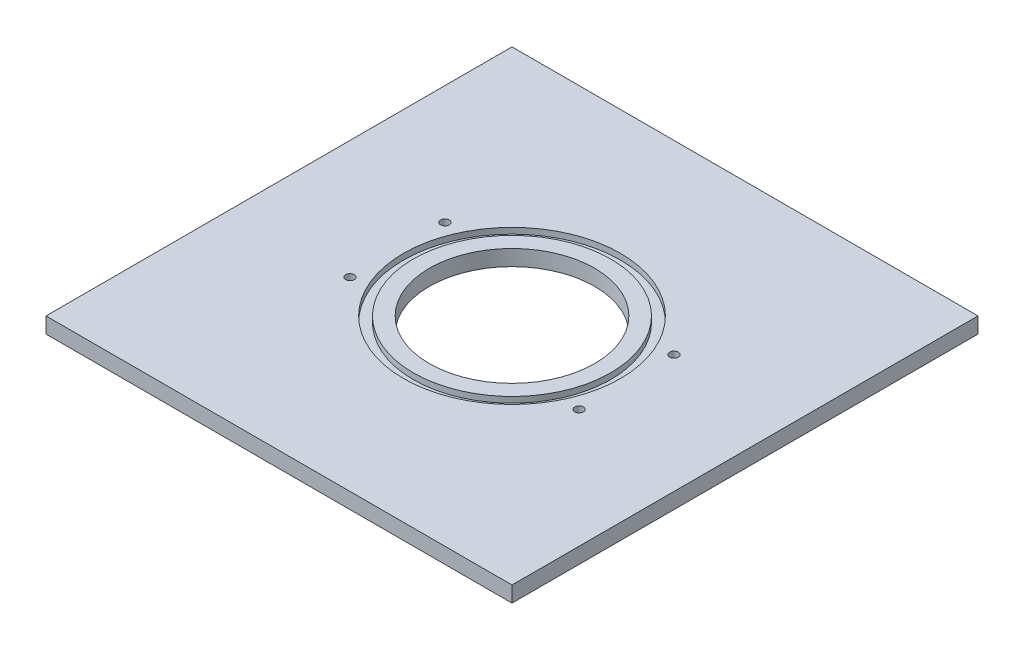
ISO-10303-21;
HEADER;
FILE_DESCRIPTION(('STEP AP214'),'2;1');
FILE_NAME('part.step','',(''),(''),'','','');
FILE_SCHEMA(('AUTOMOTIVE_DESIGN { 1 0 10303 214 1 1 1 1 }'));
ENDSEC;
DATA;
#1=APPLICATION_CONTEXT('core data for automotive mechanical design processes');
#2=APPLICATION_PROTOCOL_DEFINITION('international standard','automotive_design',2000,#1);
#3=PRODUCT_CONTEXT('',#1,'mechanical');
#4=PRODUCT('Part','Part','',(#3));
#5=PRODUCT_RELATED_PRODUCT_CATEGORY('part','',(#4));
#6=PRODUCT_DEFINITION_FORMATION('','',#4);
#7=PRODUCT_DEFINITION_CONTEXT('part definition',#1,'design');
#8=PRODUCT_DEFINITION('design','',#6,#7);
#9=PRODUCT_DEFINITION_SHAPE('','',#8);
#10=(LENGTH_UNIT() NAMED_UNIT(*) SI_UNIT(.MILLI.,.METRE.));
#11=(NAMED_UNIT(*) PLANE_ANGLE_UNIT() SI_UNIT($,.RADIAN.));
#12=(NAMED_UNIT(*) SI_UNIT($,.STERADIAN.) SOLID_ANGLE_UNIT());
#13=UNCERTAINTY_MEASURE_WITH_UNIT(LENGTH_MEASURE(1.E-05),#10,'distance_accuracy_value','');
#14=(GEOMETRIC_REPRESENTATION_CONTEXT(3) GLOBAL_UNCERTAINTY_ASSIGNED_CONTEXT((#13)) GLOBAL_UNIT_ASSIGNED_CONTEXT((#10,
#11,#12)) REPRESENTATION_CONTEXT('',''));
#15=CARTESIAN_POINT('',(0.,0.,0.));
#16=DIRECTION('',(0.,0.,1.));
#17=DIRECTION('',(1.,0.,0.));
#18=AXIS2_PLACEMENT_3D('',#15,#16,#17);
#19=CARTESIAN_POINT('',(0.,7.62,0.));
#20=DIRECTION('',(0.,1.,0.));
#21=DIRECTION('',(0.,0.,1.));
#22=AXIS2_PLACEMENT_3D('',#19,#20,#21);
#23=PLANE('',#22);
#24=CARTESIAN_POINT('',(0.,7.62,0.));
#25=DIRECTION('',(0.,1.,0.));
#26=DIRECTION('',(0.,0.,1.));
#27=AXIS2_PLACEMENT_3D('',#24,#25,#26);
#28=CIRCLE('',#27,40.);
#29=CARTESIAN_POINT('',(0.,7.62,-40.));
#30=VERTEX_POINT('',#29);
#31=EDGE_CURVE('E113',#30,#30,#28,.T.);
#32=ORIENTED_EDGE('',*,*,#31,.F.);
#33=EDGE_LOOP('',(#32));
#34=FACE_BOUND('',#33,.T.);
#35=CARTESIAN_POINT('',(0.,7.62,0.));
#36=DIRECTION('',(0.,1.,0.));
#37=DIRECTION('',(0.,0.,1.));
#38=AXIS2_PLACEMENT_3D('',#35,#36,#37);
#39=CIRCLE('',#38,47.7502);
#40=CARTESIAN_POINT('',(0.,7.62,47.7502));
#41=VERTEX_POINT('',#40);
#42=EDGE_CURVE('E130',#41,#41,#39,.T.);
#43=ORIENTED_EDGE('',*,*,#42,.T.);
#44=EDGE_LOOP('',(#43));
#45=FACE_BOUND('',#44,.T.);
#46=ADVANCED_FACE('F45',(#34,#45),#23,.T.);
#47=CARTESIAN_POINT('',(112.776,7.62,0.));
#48=DIRECTION('',(1.,0.,0.));
#49=DIRECTION('',(0.,0.,-1.));
#50=AXIS2_PLACEMENT_3D('',#47,#48,#49);
#51=PLANE('',#50);
#52=DIRECTION('',(0.,0.,1.));
#53=VECTOR('',#52,1.);
#54=CARTESIAN_POINT('',(112.776,0.,0.));
#55=LINE('',#54,#53);
#56=CARTESIAN_POINT('',(112.776,0.,-112.776));
#57=VERTEX_POINT('',#56);
#58=CARTESIAN_POINT('',(112.776,0.,112.776));
#59=VERTEX_POINT('',#58);
#60=EDGE_CURVE('E116',#57,#59,#55,.T.);
#61=ORIENTED_EDGE('',*,*,#60,.F.);
#62=DIRECTION('',(0.,-1.,0.));
#63=VECTOR('',#62,1.);
#64=CARTESIAN_POINT('',(112.776,7.62,-112.776));
#65=LINE('',#64,#63);
#66=CARTESIAN_POINT('',(112.776,7.62,-112.776));
#67=VERTEX_POINT('',#66);
#68=EDGE_CURVE('E12',#67,#57,#65,.T.);
#69=ORIENTED_EDGE('',*,*,#68,.F.);
#70=DIRECTION('',(0.,0.,1.));
#71=VECTOR('',#70,1.);
#72=CARTESIAN_POINT('',(112.776,7.62,0.));
#73=LINE('',#72,#71);
#74=CARTESIAN_POINT('',(112.776,7.62,112.776));
#75=VERTEX_POINT('',#74);
#76=EDGE_CURVE('E106',#67,#75,#73,.T.);
#77=ORIENTED_EDGE('',*,*,#76,.T.);
#78=DIRECTION('',(0.,-1.,0.));
#79=VECTOR('',#78,1.);
#80=CARTESIAN_POINT('',(112.776,7.62,112.776));
#81=LINE('',#80,#79);
#82=EDGE_CURVE('E86',#75,#59,#81,.T.);
#83=ORIENTED_EDGE('',*,*,#82,.T.);
#84=EDGE_LOOP('',(#61,#69,#77,#83));
#85=FACE_BOUND('',#84,.T.);
#86=ADVANCED_FACE('F47',(#85),#51,.T.);
#87=CARTESIAN_POINT('',(0.,7.62,-112.776));
#88=DIRECTION('',(0.,0.,-1.));
#89=DIRECTION('',(-1.,0.,0.));
#90=AXIS2_PLACEMENT_3D('',#87,#88,#89);
#91=PLANE('',#90);
#92=DIRECTION('',(1.,0.,0.));
#93=VECTOR('',#92,1.);
#94=CARTESIAN_POINT('',(0.,0.,-112.776));
#95=LINE('',#94,#93);
#96=CARTESIAN_POINT('',(-112.776,0.,-112.776));
#97=VERTEX_POINT('',#96);
#98=EDGE_CURVE('E99',#97,#57,#95,.T.);
#99=ORIENTED_EDGE('',*,*,#98,.F.);
#100=DIRECTION('',(0.,-1.,0.));
#101=VECTOR('',#100,1.);
#102=CARTESIAN_POINT('',(-112.776,7.62,-112.776));
#103=LINE('',#102,#101);
#104=CARTESIAN_POINT('',(-112.776,7.62,-112.776));
#105=VERTEX_POINT('',#104);
#106=EDGE_CURVE('E55',#105,#97,#103,.T.);
#107=ORIENTED_EDGE('',*,*,#106,.F.);
#108=DIRECTION('',(1.,0.,0.));
#109=VECTOR('',#108,1.);
#110=CARTESIAN_POINT('',(0.,7.62,-112.776));
#111=LINE('',#110,#109);
#112=EDGE_CURVE('E97',#105,#67,#111,.T.);
#113=ORIENTED_EDGE('',*,*,#112,.T.);
#114=ORIENTED_EDGE('',*,*,#68,.T.);
#115=EDGE_LOOP('',(#99,#107,#113,#114));
#116=FACE_BOUND('',#115,.T.);
#117=ADVANCED_FACE('F95',(#116),#91,.T.);
#118=CARTESIAN_POINT('',(-112.776,7.62,0.));
#119=DIRECTION('',(1.,0.,0.));
#120=DIRECTION('',(0.,0.,-1.));
#121=AXIS2_PLACEMENT_3D('',#118,#119,#120);
#122=PLANE('',#121);
#123=DIRECTION('',(0.,0.,1.));
#124=VECTOR('',#123,1.);
#125=CARTESIAN_POINT('',(-112.776,0.,0.));
#126=LINE('',#125,#124);
#127=CARTESIAN_POINT('',(-112.776,0.,112.776));
#128=VERTEX_POINT('',#127);
#129=EDGE_CURVE('E79',#97,#128,#126,.T.);
#130=ORIENTED_EDGE('',*,*,#129,.T.);
#131=DIRECTION('',(0.,-1.,0.));
#132=VECTOR('',#131,1.);
#133=CARTESIAN_POINT('',(-112.776,7.62,112.776));
#134=LINE('',#133,#132);
#135=CARTESIAN_POINT('',(-112.776,7.62,112.776));
#136=VERTEX_POINT('',#135);
#137=EDGE_CURVE('E100',#136,#128,#134,.T.);
#138=ORIENTED_EDGE('',*,*,#137,.F.);
#139=DIRECTION('',(0.,0.,1.));
#140=VECTOR('',#139,1.);
#141=CARTESIAN_POINT('',(-112.776,7.62,0.));
#142=LINE('',#141,#140);
#143=EDGE_CURVE('E102',#105,#136,#142,.T.);
#144=ORIENTED_EDGE('',*,*,#143,.F.);
#145=ORIENTED_EDGE('',*,*,#106,.T.);
#146=EDGE_LOOP('',(#130,#138,#144,#145));
#147=FACE_BOUND('',#146,.T.);
#148=ADVANCED_FACE('F103',(#147),#122,.F.);
#149=CARTESIAN_POINT('',(0.,7.62,112.776));
#150=DIRECTION('',(0.,0.,-1.));
#151=DIRECTION('',(-1.,0.,0.));
#152=AXIS2_PLACEMENT_3D('',#149,#150,#151);
#153=PLANE('',#152);
#154=DIRECTION('',(1.,0.,0.));
#155=VECTOR('',#154,1.);
#156=CARTESIAN_POINT('',(0.,0.,112.776));
#157=LINE('',#156,#155);
#158=EDGE_CURVE('E122',#128,#59,#157,.T.);
#159=ORIENTED_EDGE('',*,*,#158,.T.);
#160=ORIENTED_EDGE('',*,*,#82,.F.);
#161=DIRECTION('',(1.,0.,0.));
#162=VECTOR('',#161,1.);
#163=CARTESIAN_POINT('',(0.,7.62,112.776));
#164=LINE('',#163,#162);
#165=EDGE_CURVE('E64',#136,#75,#164,.T.);
#166=ORIENTED_EDGE('',*,*,#165,.F.);
#167=ORIENTED_EDGE('',*,*,#137,.T.);
#168=EDGE_LOOP('',(#159,#160,#166,#167));
#169=FACE_BOUND('',#168,.T.);
#170=ADVANCED_FACE('F171',(#169),#153,.F.);
#171=CARTESIAN_POINT('',(0.,7.62,0.));
#172=DIRECTION('',(0.,-1.,0.));
#173=DIRECTION('',(0.,0.,-1.));
#174=AXIS2_PLACEMENT_3D('',#171,#172,#173);
#175=CYLINDRICAL_SURFACE('',#174,40.);
#176=CARTESIAN_POINT('',(0.,0.,0.));
#177=DIRECTION('',(0.,1.,0.));
#178=DIRECTION('',(0.,0.,1.));
#179=AXIS2_PLACEMENT_3D('',#176,#177,#178);
#180=CIRCLE('',#179,40.);
#181=CARTESIAN_POINT('',(0.,0.,-40.));
#182=VERTEX_POINT('',#181);
#183=EDGE_CURVE('E108',#182,#182,#180,.T.);
#184=CARTESIAN_POINT('',(0.,7.62,-40.));
#185=CARTESIAN_POINT('',(0.,7.540625,-40.));
#186=CARTESIAN_POINT('',(0.,7.46125,-40.));
#187=CARTESIAN_POINT('',(0.,7.3025,-40.));
#188=CARTESIAN_POINT('',(0.,7.223125,-40.));
#189=CARTESIAN_POINT('',(0.,7.064375,-40.));
#190=CARTESIAN_POINT('',(0.,6.985,-40.));
#191=CARTESIAN_POINT('',(0.,6.82625,-40.));
#192=CARTESIAN_POINT('',(0.,6.746875,-40.));
#193=CARTESIAN_POINT('',(0.,6.588125,-40.));
#194=CARTESIAN_POINT('',(0.,6.50875,-40.));
#195=CARTESIAN_POINT('',(0.,6.35,-40.));
#196=CARTESIAN_POINT('',(0.,6.270625,-40.));
#197=CARTESIAN_POINT('',(0.,6.111875,-40.));
#198=CARTESIAN_POINT('',(0.,6.0325,-40.));
#199=CARTESIAN_POINT('',(0.,5.87375,-40.));
#200=CARTESIAN_POINT('',(0.,5.794375,-40.));
#201=CARTESIAN_POINT('',(0.,5.635625,-40.));
#202=CARTESIAN_POINT('',(0.,5.55625,-40.));
#203=CARTESIAN_POINT('',(0.,5.3975,-40.));
#204=CARTESIAN_POINT('',(0.,5.318125,-40.));
#205=CARTESIAN_POINT('',(0.,5.159375,-40.));
#206=CARTESIAN_POINT('',(0.,5.08,-40.));
#207=CARTESIAN_POINT('',(0.,4.92125,-40.));
#208=CARTESIAN_POINT('',(0.,4.841875,-40.));
#209=CARTESIAN_POINT('',(0.,4.683125,-40.));
#210=CARTESIAN_POINT('',(0.,4.60375,-40.));
#211=CARTESIAN_POINT('',(0.,4.445,-40.));
#212=CARTESIAN_POINT('',(0.,4.365625,-40.));
#213=CARTESIAN_POINT('',(0.,4.206875,-40.));
#214=CARTESIAN_POINT('',(0.,4.1275,-40.));
#215=CARTESIAN_POINT('',(0.,3.96875,-40.));
#216=CARTESIAN_POINT('',(0.,3.889375,-40.));
#217=CARTESIAN_POINT('',(0.,3.730625,-40.));
#218=CARTESIAN_POINT('',(0.,3.65125,-40.));
#219=CARTESIAN_POINT('',(0.,3.4925,-40.));
#220=CARTESIAN_POINT('',(0.,3.413125,-40.));
#221=CARTESIAN_POINT('',(0.,3.254375,-40.));
#222=CARTESIAN_POINT('',(0.,3.175,-40.));
#223=CARTESIAN_POINT('',(0.,3.01625,-40.));
#224=CARTESIAN_POINT('',(0.,2.936875,-40.));
#225=CARTESIAN_POINT('',(0.,2.778125,-40.));
#226=CARTESIAN_POINT('',(0.,2.69875,-40.));
#227=CARTESIAN_POINT('',(0.,2.54,-40.));
#228=CARTESIAN_POINT('',(0.,2.460625,-40.));
#229=CARTESIAN_POINT('',(0.,2.301875,-40.));
#230=CARTESIAN_POINT('',(0.,2.2225,-40.));
#231=CARTESIAN_POINT('',(0.,2.06375,-40.));
#232=CARTESIAN_POINT('',(0.,1.984375,-40.));
#233=CARTESIAN_POINT('',(0.,1.825625,-40.));
#234=CARTESIAN_POINT('',(0.,1.74625,-40.));
#235=CARTESIAN_POINT('',(0.,1.5875,-40.));
#236=CARTESIAN_POINT('',(0.,1.508125,-40.));
#237=CARTESIAN_POINT('',(0.,1.349375,-40.));
#238=CARTESIAN_POINT('',(0.,1.27,-40.));
#239=CARTESIAN_POINT('',(0.,1.11125,-40.));
#240=CARTESIAN_POINT('',(0.,1.031875,-40.));
#241=CARTESIAN_POINT('',(0.,0.873125,-40.));
#242=CARTESIAN_POINT('',(0.,0.79375,-40.));
#243=CARTESIAN_POINT('',(0.,0.635,-40.));
#244=CARTESIAN_POINT('',(0.,0.555625,-40.));
#245=CARTESIAN_POINT('',(0.,0.396875,-40.));
#246=CARTESIAN_POINT('',(0.,0.3175,-40.));
#247=CARTESIAN_POINT('',(0.,0.15875,-40.));
#248=CARTESIAN_POINT('',(0.,0.0793749999999999,-40.));
#249=CARTESIAN_POINT('',(0.,0.,-40.));
#250=B_SPLINE_CURVE_WITH_KNOTS('',3,(#184,#185,#186,#187,#188,#189,#190,#191,#192,#193,#194,
#195,#196,#197,#198,#199,#200,#201,#202,#203,#204,#205,#206,#207,#208,#209,#210,#211,#212,#213,
#214,#215,#216,#217,#218,#219,#220,#221,#222,#223,#224,#225,#226,#227,#228,#229,#230,#231,#232,
#233,#234,#235,#236,#237,#238,#239,#240,#241,#242,#243,#244,#245,#246,#247,#248,#249),
.UNSPECIFIED.,.F.,.F.,(4,2,2,2,2,2,2,2,2,2,2,2,2,2,2,2,2,2,2,2,2,2,2,2,2,2,2,2,2,2,2,2,4),(0.,
0.238125,0.47625,0.714375000000001,0.9525,1.190625,1.42875,1.666875,1.905,2.143125,2.38125,
2.619375,2.8575,3.095625,3.33375,3.571875,3.81,4.048125,4.28625,4.524375,4.7625,5.000625,
5.23875,5.476875,5.715,5.953125,6.19125,6.429375,6.6675,6.905625,7.14375,7.381875,7.62),.UNSPECIFIED.);
#251=EDGE_CURVE('BSEAM162',#30,#182,#250,.T.);
#252=ORIENTED_EDGE('',*,*,#31,.T.);
#253=ORIENTED_EDGE('',*,*,#183,.F.);
#254=ORIENTED_EDGE('',*,*,#251,.T.);
#255=ORIENTED_EDGE('',*,*,#251,.F.);
#256=EDGE_LOOP('',(#252,#254,#253,#255));
#257=FACE_BOUND('',#256,.T.);
#258=ADVANCED_FACE('F162',(#257),#175,.F.);
#259=CARTESIAN_POINT('',(55.4327719506775,7.62,22.9610059419047));
#260=DIRECTION('',(0.,1.,0.));
#261=DIRECTION('',(0.,0.,1.));
#262=AXIS2_PLACEMENT_3D('',#259,#260,#261);
#263=CIRCLE('',#262,2.09999999999999);
#264=CARTESIAN_POINT('',(55.4327719506775,7.62,25.0610059419047));
#265=VERTEX_POINT('',#264);
#266=EDGE_CURVE('E355',#265,#265,#263,.T.);
#267=ORIENTED_EDGE('',*,*,#266,.F.);
#268=EDGE_LOOP('',(#267));
#269=FACE_BOUND('',#268,.T.);
#270=CARTESIAN_POINT('',(-55.4327719506772,7.62,22.9610059419054));
#271=DIRECTION('',(0.,1.,0.));
#272=DIRECTION('',(0.,0.,1.));
#273=AXIS2_PLACEMENT_3D('',#270,#271,#272);
#274=CIRCLE('',#273,2.09999999999999);
#275=CARTESIAN_POINT('',(-55.4327719506772,7.62,25.0610059419054));
#276=VERTEX_POINT('',#275);
#277=EDGE_CURVE('E144',#276,#276,#274,.T.);
#278=ORIENTED_EDGE('',*,*,#277,.F.);
#279=EDGE_LOOP('',(#278));
#280=FACE_BOUND('',#279,.T.);
#281=CARTESIAN_POINT('',(-55.4327719506773,7.62,-22.9610059419051));
#282=DIRECTION('',(0.,1.,0.));
#283=DIRECTION('',(0.,0.,1.));
#284=AXIS2_PLACEMENT_3D('',#281,#282,#283);
#285=CIRCLE('',#284,2.09999999999999);
#286=CARTESIAN_POINT('',(-55.4327719506773,7.62,-20.8610059419051));
#287=VERTEX_POINT('',#286);
#288=EDGE_CURVE('E134',#287,#287,#285,.T.);
#289=ORIENTED_EDGE('',*,*,#288,.F.);
#290=EDGE_LOOP('',(#289));
#291=FACE_BOUND('',#290,.T.);
#292=CARTESIAN_POINT('',(55.4327719506772,7.62,-22.9610059419054));
#293=DIRECTION('',(0.,1.,0.));
#294=DIRECTION('',(0.,0.,1.));
#295=AXIS2_PLACEMENT_3D('',#292,#293,#294);
#296=CIRCLE('',#295,2.09999999999999);
#297=CARTESIAN_POINT('',(55.4327719506772,7.62,-20.8610059419054));
#298=VERTEX_POINT('',#297);
#299=EDGE_CURVE('E131',#298,#298,#296,.T.);
#300=ORIENTED_EDGE('',*,*,#299,.F.);
#301=EDGE_LOOP('',(#300));
#302=FACE_BOUND('',#301,.T.);
#303=CARTESIAN_POINT('',(0.,7.62,0.));
#304=DIRECTION('',(0.,1.,0.));
#305=DIRECTION('',(0.,0.,1.));
#306=AXIS2_PLACEMENT_3D('',#303,#304,#305);
#307=CIRCLE('',#306,52.5);
#308=CARTESIAN_POINT('',(0.,7.62,52.5));
#309=VERTEX_POINT('',#308);
#310=EDGE_CURVE('E151',#309,#309,#307,.T.);
#311=ORIENTED_EDGE('',*,*,#310,.F.);
#312=EDGE_LOOP('',(#311));
#313=FACE_BOUND('',#312,.T.);
#314=ORIENTED_EDGE('',*,*,#76,.F.);
#315=ORIENTED_EDGE('',*,*,#112,.F.);
#316=ORIENTED_EDGE('',*,*,#143,.T.);
#317=ORIENTED_EDGE('',*,*,#165,.T.);
#318=EDGE_LOOP('',(#314,#315,#316,#317));
#319=FACE_BOUND('',#318,.T.);
#320=ADVANCED_FACE('F105',(#269,#280,#291,#302,#313,#319),#23,.T.);
#321=CARTESIAN_POINT('',(0.,0.,0.));
#322=DIRECTION('',(0.,1.,0.));
#323=DIRECTION('',(0.,0.,1.));
#324=AXIS2_PLACEMENT_3D('',#321,#322,#323);
#325=PLANE('',#324);
#326=CARTESIAN_POINT('',(55.4327719506775,0.,22.9610059419047));
#327=DIRECTION('',(0.,1.,0.));
#328=DIRECTION('',(0.,0.,1.));
#329=AXIS2_PLACEMENT_3D('',#326,#327,#328);
#330=CIRCLE('',#329,2.09999999999999);
#331=CARTESIAN_POINT('',(55.4327719506775,0.,25.0610059419047));
#332=VERTEX_POINT('',#331);
#333=EDGE_CURVE('E358',#332,#332,#330,.T.);
#334=ORIENTED_EDGE('',*,*,#333,.T.);
#335=EDGE_LOOP('',(#334));
#336=FACE_BOUND('',#335,.T.);
#337=CARTESIAN_POINT('',(-55.4327719506772,0.,22.9610059419054));
#338=DIRECTION('',(0.,1.,0.));
#339=DIRECTION('',(0.,0.,1.));
#340=AXIS2_PLACEMENT_3D('',#337,#338,#339);
#341=CIRCLE('',#340,2.09999999999999);
#342=CARTESIAN_POINT('',(-55.4327719506772,0.,25.0610059419054));
#343=VERTEX_POINT('',#342);
#344=EDGE_CURVE('E49',#343,#343,#341,.T.);
#345=ORIENTED_EDGE('',*,*,#344,.T.);
#346=EDGE_LOOP('',(#345));
#347=FACE_BOUND('',#346,.T.);
#348=CARTESIAN_POINT('',(-55.4327719506773,0.,-22.9610059419051));
#349=DIRECTION('',(0.,1.,0.));
#350=DIRECTION('',(0.,0.,1.));
#351=AXIS2_PLACEMENT_3D('',#348,#349,#350);
#352=CIRCLE('',#351,2.09999999999999);
#353=CARTESIAN_POINT('',(-55.4327719506773,0.,-20.8610059419051));
#354=VERTEX_POINT('',#353);
#355=EDGE_CURVE('E132',#354,#354,#352,.T.);
#356=ORIENTED_EDGE('',*,*,#355,.T.);
#357=EDGE_LOOP('',(#356));
#358=FACE_BOUND('',#357,.T.);
#359=CARTESIAN_POINT('',(55.4327719506772,0.,-22.9610059419054));
#360=DIRECTION('',(0.,1.,0.));
#361=DIRECTION('',(0.,0.,1.));
#362=AXIS2_PLACEMENT_3D('',#359,#360,#361);
#363=CIRCLE('',#362,2.09999999999999);
#364=CARTESIAN_POINT('',(55.4327719506772,0.,-20.8610059419054));
#365=VERTEX_POINT('',#364);
#366=EDGE_CURVE('E128',#365,#365,#363,.T.);
#367=ORIENTED_EDGE('',*,*,#366,.T.);
#368=EDGE_LOOP('',(#367));
#369=FACE_BOUND('',#368,.T.);
#370=ORIENTED_EDGE('',*,*,#60,.T.);
#371=ORIENTED_EDGE('',*,*,#158,.F.);
#372=ORIENTED_EDGE('',*,*,#129,.F.);
#373=ORIENTED_EDGE('',*,*,#98,.T.);
#374=EDGE_LOOP('',(#370,#371,#372,#373));
#375=FACE_BOUND('',#374,.T.);
#376=ORIENTED_EDGE('',*,*,#183,.T.);
#377=EDGE_LOOP('',(#376));
#378=FACE_BOUND('',#377,.T.);
#379=ADVANCED_FACE('F161',(#336,#347,#358,#369,#375,#378),#325,.F.);
#380=CARTESIAN_POINT('',(0.,4.7752,0.));
#381=DIRECTION('',(0.,1.,0.));
#382=DIRECTION('',(0.,0.,1.));
#383=AXIS2_PLACEMENT_3D('',#380,#381,#382);
#384=CYLINDRICAL_SURFACE('',#383,52.5);
#385=CARTESIAN_POINT('',(0.,4.7752,0.));
#386=DIRECTION('',(0.,1.,0.));
#387=DIRECTION('',(0.,0.,1.));
#388=AXIS2_PLACEMENT_3D('',#385,#386,#387);
#389=CIRCLE('',#388,52.5);
#390=CARTESIAN_POINT('',(0.,4.7752,52.5));
#391=VERTEX_POINT('',#390);
#392=EDGE_CURVE('E119',#391,#391,#389,.T.);
#393=ORIENTED_EDGE('',*,*,#392,.F.);
#394=EDGE_LOOP('',(#393));
#395=FACE_BOUND('',#394,.T.);
#396=ORIENTED_EDGE('',*,*,#310,.T.);
#397=EDGE_LOOP('',(#396));
#398=FACE_BOUND('',#397,.T.);
#399=ADVANCED_FACE('F158',(#395,#398),#384,.F.);
#400=CARTESIAN_POINT('',(0.,4.7752,0.));
#401=DIRECTION('',(0.,1.,0.));
#402=DIRECTION('',(0.,0.,1.));
#403=AXIS2_PLACEMENT_3D('',#400,#401,#402);
#404=PLANE('',#403);
#405=CARTESIAN_POINT('',(0.,4.7752,0.));
#406=DIRECTION('',(0.,1.,0.));
#407=DIRECTION('',(0.,0.,1.));
#408=AXIS2_PLACEMENT_3D('',#405,#406,#407);
#409=CIRCLE('',#408,47.7502);
#410=CARTESIAN_POINT('',(0.,4.7752,47.7502));
#411=VERTEX_POINT('',#410);
#412=EDGE_CURVE('E148',#411,#411,#409,.T.);
#413=ORIENTED_EDGE('',*,*,#412,.F.);
#414=EDGE_LOOP('',(#413));
#415=FACE_BOUND('',#414,.T.);
#416=ORIENTED_EDGE('',*,*,#392,.T.);
#417=EDGE_LOOP('',(#416));
#418=FACE_BOUND('',#417,.T.);
#419=ADVANCED_FACE('F189',(#415,#418),#404,.T.);
#420=CARTESIAN_POINT('',(0.,4.7752,0.));
#421=DIRECTION('',(0.,1.,0.));
#422=DIRECTION('',(0.,0.,1.));
#423=AXIS2_PLACEMENT_3D('',#420,#421,#422);
#424=CYLINDRICAL_SURFACE('',#423,47.7502);
#425=ORIENTED_EDGE('',*,*,#412,.T.);
#426=EDGE_LOOP('',(#425));
#427=FACE_BOUND('',#426,.T.);
#428=ORIENTED_EDGE('',*,*,#42,.F.);
#429=EDGE_LOOP('',(#428));
#430=FACE_BOUND('',#429,.T.);
#431=ADVANCED_FACE('F186',(#427,#430),#424,.T.);
#432=CARTESIAN_POINT('',(55.4327719506772,7.62,-22.9610059419054));
#433=DIRECTION('',(0.,1.,0.));
#434=DIRECTION('',(0.,0.,1.));
#435=AXIS2_PLACEMENT_3D('',#432,#433,#434);
#436=CYLINDRICAL_SURFACE('',#435,2.09999999999999);
#437=ORIENTED_EDGE('',*,*,#299,.T.);
#438=EDGE_LOOP('',(#437));
#439=FACE_BOUND('',#438,.T.);
#440=ORIENTED_EDGE('',*,*,#366,.F.);
#441=EDGE_LOOP('',(#440));
#442=FACE_BOUND('',#441,.T.);
#443=ADVANCED_FACE('F188',(#439,#442),#436,.F.);
#444=CARTESIAN_POINT('',(-55.4327719506773,7.62,-22.9610059419051));
#445=DIRECTION('',(0.,1.,0.));
#446=DIRECTION('',(0.,0.,1.));
#447=AXIS2_PLACEMENT_3D('',#444,#445,#446);
#448=CYLINDRICAL_SURFACE('',#447,2.09999999999999);
#449=ORIENTED_EDGE('',*,*,#288,.T.);
#450=EDGE_LOOP('',(#449));
#451=FACE_BOUND('',#450,.T.);
#452=ORIENTED_EDGE('',*,*,#355,.F.);
#453=EDGE_LOOP('',(#452));
#454=FACE_BOUND('',#453,.T.);
#455=ADVANCED_FACE('F196',(#451,#454),#448,.F.);
#456=CARTESIAN_POINT('',(-55.4327719506772,7.62,22.9610059419054));
#457=DIRECTION('',(0.,1.,0.));
#458=DIRECTION('',(0.,0.,1.));
#459=AXIS2_PLACEMENT_3D('',#456,#457,#458);
#460=CYLINDRICAL_SURFACE('',#459,2.09999999999999);
#461=ORIENTED_EDGE('',*,*,#277,.T.);
#462=EDGE_LOOP('',(#461));
#463=FACE_BOUND('',#462,.T.);
#464=ORIENTED_EDGE('',*,*,#344,.F.);
#465=EDGE_LOOP('',(#464));
#466=FACE_BOUND('',#465,.T.);
#467=ADVANCED_FACE('F252',(#463,#466),#460,.F.);
#468=CARTESIAN_POINT('',(55.4327719506775,7.62,22.9610059419047));
#469=DIRECTION('',(0.,1.,0.));
#470=DIRECTION('',(0.,0.,1.));
#471=AXIS2_PLACEMENT_3D('',#468,#469,#470);
#472=CYLINDRICAL_SURFACE('',#471,2.09999999999999);
#473=ORIENTED_EDGE('',*,*,#266,.T.);
#474=EDGE_LOOP('',(#473));
#475=FACE_BOUND('',#474,.T.);
#476=ORIENTED_EDGE('',*,*,#333,.F.);
#477=EDGE_LOOP('',(#476));
#478=FACE_BOUND('',#477,.T.);
#479=ADVANCED_FACE('F261',(#475,#478),#472,.F.);
#480=CLOSED_SHELL('',(#46,#86,#117,#148,#170,#258,#320,#379,#399,#419,#431,#443,#455,#467,#479));
#481=MANIFOLD_SOLID_BREP('B2',#480);
#482=ADVANCED_BREP_SHAPE_REPRESENTATION('',(#18,#481),#14);
#483=SHAPE_DEFINITION_REPRESENTATION(#9,#482);
ENDSEC;
END-ISO-10303-21;
